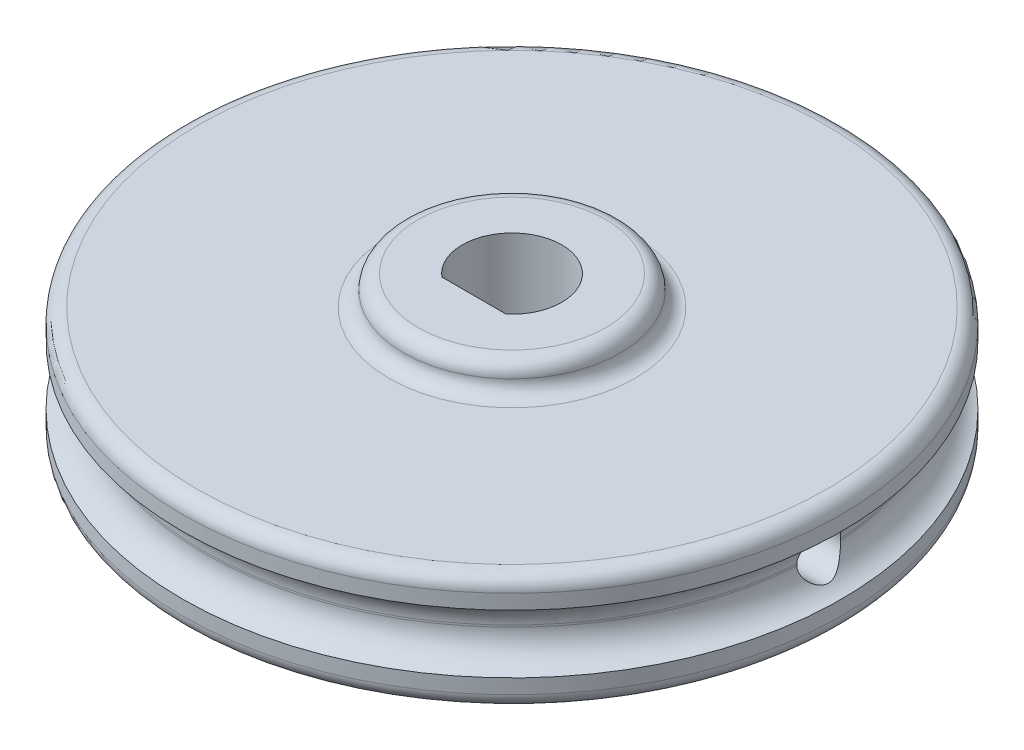
ISO-10303-21;
HEADER;
FILE_DESCRIPTION(('STEP AP214'),'2;1');
FILE_NAME('part.step','',(''),(''),'','','');
FILE_SCHEMA(('AUTOMOTIVE_DESIGN { 1 0 10303 214 1 1 1 1 }'));
ENDSEC;
DATA;
#1=APPLICATION_CONTEXT('core data for automotive mechanical design processes');
#2=APPLICATION_PROTOCOL_DEFINITION('international standard','automotive_design',2000,#1);
#3=PRODUCT_CONTEXT('',#1,'mechanical');
#4=PRODUCT('Part','Part','',(#3));
#5=PRODUCT_RELATED_PRODUCT_CATEGORY('part','',(#4));
#6=PRODUCT_DEFINITION_FORMATION('','',#4);
#7=PRODUCT_DEFINITION_CONTEXT('part definition',#1,'design');
#8=PRODUCT_DEFINITION('design','',#6,#7);
#9=PRODUCT_DEFINITION_SHAPE('','',#8);
#10=(LENGTH_UNIT() NAMED_UNIT(*) SI_UNIT(.MILLI.,.METRE.));
#11=(NAMED_UNIT(*) PLANE_ANGLE_UNIT() SI_UNIT($,.RADIAN.));
#12=(NAMED_UNIT(*) SI_UNIT($,.STERADIAN.) SOLID_ANGLE_UNIT());
#13=UNCERTAINTY_MEASURE_WITH_UNIT(LENGTH_MEASURE(1.E-05),#10,'distance_accuracy_value','');
#14=(GEOMETRIC_REPRESENTATION_CONTEXT(3) GLOBAL_UNCERTAINTY_ASSIGNED_CONTEXT((#13)) GLOBAL_UNIT_ASSIGNED_CONTEXT((#10,
#11,#12)) REPRESENTATION_CONTEXT('',''));
#15=CARTESIAN_POINT('',(0.,0.,0.));
#16=DIRECTION('',(0.,0.,1.));
#17=DIRECTION('',(1.,0.,0.));
#18=AXIS2_PLACEMENT_3D('',#15,#16,#17);
#19=CARTESIAN_POINT('',(0.,1.,0.));
#20=DIRECTION('',(0.,1.,0.));
#21=DIRECTION('',(0.,0.,1.));
#22=AXIS2_PLACEMENT_3D('',#19,#20,#21);
#23=CYLINDRICAL_SURFACE('',#22,10.5);
#24=CARTESIAN_POINT('',(10.5,1.25,0.));
#25=CARTESIAN_POINT('',(10.4999996459103,1.25000184599413,-0.0420702896906977));
#26=CARTESIAN_POINT('',(10.4997444551651,1.25355171822834,-0.0841697151823444));
#27=CARTESIAN_POINT('',(10.4987509831414,1.26766139121766,-0.167205182120869));
#28=CARTESIAN_POINT('',(10.498012145491,1.27822926546172,-0.208139826981758));
#29=CARTESIAN_POINT('',(10.4961349265712,1.30606904120026,-0.287631003955275));
#30=CARTESIAN_POINT('',(10.4949967621383,1.32333730488777,-0.326188813369015));
#31=CARTESIAN_POINT('',(10.4924487544025,1.36408153169771,-0.399848850525432));
#32=CARTESIAN_POINT('',(10.4910389717174,1.38755611017494,-0.434951846651903));
#33=CARTESIAN_POINT('',(10.4881030726537,1.44009542926148,-0.500782673246313));
#34=CARTESIAN_POINT('',(10.4865767636156,1.46916955424612,-0.531503006126405));
#35=CARTESIAN_POINT('',(10.4835814686867,1.53206306264146,-0.587632246842263));
#36=CARTESIAN_POINT('',(10.4821124852406,1.56588264814997,-0.613040928352703));
#37=CARTESIAN_POINT('',(10.4793959681773,1.63735098714617,-0.657849846643447));
#38=CARTESIAN_POINT('',(10.4781486713077,1.67500376758182,-0.67724367619479));
#39=CARTESIAN_POINT('',(10.4760187472181,1.7530415126039,-0.7094314113739));
#40=CARTESIAN_POINT('',(10.4751361150887,1.79342644040015,-0.722225405852854));
#41=CARTESIAN_POINT('',(10.4738369325609,1.87570839162719,-0.740829017574956));
#42=CARTESIAN_POINT('',(10.4734195824702,1.91760269248613,-0.746650619734161));
#43=CARTESIAN_POINT('',(10.4730956369413,2.00177576001648,-0.751181201960244));
#44=CARTESIAN_POINT('',(10.4731890342245,2.04405452120034,-0.749890283388113));
#45=CARTESIAN_POINT('',(10.4738753090453,2.12771452376762,-0.740242395612946));
#46=CARTESIAN_POINT('',(10.474467268304,2.16909727184382,-0.73189841702248));
#47=CARTESIAN_POINT('',(10.4760825183323,2.24987332351781,-0.708401426837434));
#48=CARTESIAN_POINT('',(10.47710581233,2.28926661222396,-0.693248364283407));
#49=CARTESIAN_POINT('',(10.4794694790249,2.36498712035384,-0.656548677846591));
#50=CARTESIAN_POINT('',(10.4808101424809,2.40131148652241,-0.634996186479635));
#51=CARTESIAN_POINT('',(10.4836571938165,2.46983183870472,-0.586113680368512));
#52=CARTESIAN_POINT('',(10.4851635841476,2.50202776363298,-0.558783580153214));
#53=CARTESIAN_POINT('',(10.4881764228053,2.56145287140962,-0.499048612415012));
#54=CARTESIAN_POINT('',(10.4896828636933,2.58867075958108,-0.466632507153405));
#55=CARTESIAN_POINT('',(10.4925228165297,2.63727997610893,-0.39768502342269));
#56=CARTESIAN_POINT('',(10.4938563283987,2.65867130178951,-0.361153643063687));
#57=CARTESIAN_POINT('',(10.4962003244408,2.69501931635249,-0.285005555863405));
#58=CARTESIAN_POINT('',(10.4972107857048,2.7099755489187,-0.245388630459512));
#59=CARTESIAN_POINT('',(10.4987945352409,2.73302113747236,-0.164197212882698));
#60=CARTESIAN_POINT('',(10.4993678301788,2.74111059816333,-0.122622750568214));
#61=CARTESIAN_POINT('',(10.5000117922214,2.75017895251046,-0.0387943631342636));
#62=CARTESIAN_POINT('',(10.500083562751,2.75117345617865,0.00345786522529639));
#63=CARTESIAN_POINT('',(10.4997193287321,2.74606449456017,0.0875285011581588));
#64=CARTESIAN_POINT('',(10.4992833276481,2.7399610777016,0.129346911689374));
#65=CARTESIAN_POINT('',(10.4979533231659,2.72084245885006,0.211318656604785));
#66=CARTESIAN_POINT('',(10.4970597962996,2.70783444775911,0.251473676535794));
#67=CARTESIAN_POINT('',(10.4949152049575,2.6752832091945,0.329030885913476));
#68=CARTESIAN_POINT('',(10.4936641362964,2.65573990521888,0.366433043128962));
#69=CARTESIAN_POINT('',(10.4909421529722,2.61063330617983,0.437494126946804));
#70=CARTESIAN_POINT('',(10.4894708604022,2.58505961862585,0.471146442137264));
#71=CARTESIAN_POINT('',(10.4864751699143,2.52863327692314,0.533685949062769));
#72=CARTESIAN_POINT('',(10.4849507713176,2.49778055525561,0.562573079841865));
#73=CARTESIAN_POINT('',(10.4820174518027,2.43160443775544,0.614815360932158));
#74=CARTESIAN_POINT('',(10.4806087458173,2.39627301779258,0.638160360675093));
#75=CARTESIAN_POINT('',(10.4780691343544,2.32218260558675,0.678586204627138));
#76=CARTESIAN_POINT('',(10.4769382267417,2.28342363969174,0.695667096984014));
#77=CARTESIAN_POINT('',(10.4750833134738,2.20361498876529,0.723062396609295));
#78=CARTESIAN_POINT('',(10.4743589278796,2.1625674822104,0.733383123502618));
#79=CARTESIAN_POINT('',(10.4733977069656,2.07931684901751,0.74698573941904));
#80=CARTESIAN_POINT('',(10.4731608650347,2.03711373805777,0.750267723889857));
#81=CARTESIAN_POINT('',(10.4732016044349,1.95285078494325,0.749698708386966));
#82=CARTESIAN_POINT('',(10.4734780352141,1.91079083357409,0.745863661958517));
#83=CARTESIAN_POINT('',(10.4745117313722,1.82791381916018,0.731202599756694));
#84=CARTESIAN_POINT('',(10.4752689975745,1.78709675824405,0.720376572011129));
#85=CARTESIAN_POINT('',(10.4771787426215,1.70786234680122,0.692044645056291));
#86=CARTESIAN_POINT('',(10.478331211915,1.66944493830711,0.674538907278669));
#87=CARTESIAN_POINT('',(10.4809014997491,1.5960920886772,0.633346462801262));
#88=CARTESIAN_POINT('',(10.4823193124875,1.56115657142927,0.609659891251878));
#89=CARTESIAN_POINT('',(10.4852642693368,1.49567786820655,0.556718578197045));
#90=CARTESIAN_POINT('',(10.4867916386566,1.46514414213574,0.527452149288891));
#91=CARTESIAN_POINT('',(10.4897816015316,1.40941154473007,0.464200561093081));
#92=CARTESIAN_POINT('',(10.4912441792185,1.38421397462793,0.430214254191139));
#93=CARTESIAN_POINT('',(10.4939417089127,1.33984450426722,0.358438546976615));
#94=CARTESIAN_POINT('',(10.4951763209639,1.32068157368202,0.320643594660229));
#95=CARTESIAN_POINT('',(10.4972745233087,1.28899744145457,0.242390654676055));
#96=CARTESIAN_POINT('',(10.4981385447485,1.27646851778678,0.201935825086028));
#97=CARTESIAN_POINT('',(10.4991736015175,1.26163871820478,0.134364084627482));
#98=CARTESIAN_POINT('',(10.4994821105472,1.25727990411502,0.107683123255775));
#99=CARTESIAN_POINT('',(10.4998954232599,1.25145995515487,0.0540054436549144));
#100=CARTESIAN_POINT('',(10.5000002273222,1.24999881488932,0.0270087260137571));
#101=CARTESIAN_POINT('',(10.5,1.25,0.));
#102=B_SPLINE_CURVE_WITH_KNOTS('',3,(#24,#25,#26,#27,#28,#29,#30,#31,#32,#33,#34,#35,#36,#37,
#38,#39,#40,#41,#42,#43,#44,#45,#46,#47,#48,#49,#50,#51,#52,#53,#54,#55,#56,#57,#58,#59,#60,#61,
#62,#63,#64,#65,#66,#67,#68,#69,#70,#71,#72,#73,#74,#75,#76,#77,#78,#79,#80,#81,#82,#83,#84,#85,
#86,#87,#88,#89,#90,#91,#92,#93,#94,#95,#96,#97,#98,#99,#100,#101),.UNSPECIFIED.,.T.,.F.,(4,2,2,
2,2,2,2,2,2,2,2,2,2,2,2,2,2,2,2,2,2,2,2,2,2,2,2,2,2,2,2,2,2,2,2,2,2,2,4),(0.,0.126112265961033,
0.252369863006392,0.378559007381876,0.504720022348824,0.631094342082059,0.757474045429571,
0.883987914066162,1.01050007944795,1.13679446823782,1.26308705720284,1.38914754092121,
1.51520896809682,1.64138633679889,1.76756557223815,1.89402763749129,2.02048976082097,
2.14696085017569,2.27343001108324,2.39962083405724,2.52581079605448,2.65186959258432,
2.77792986480653,2.90420899213916,3.03048973470147,3.15700000977925,3.28350931244157,
3.40990018061744,3.53628933487972,3.66239551721201,3.78850191550416,3.91460526631748,
4.04070585998008,4.1670735410398,4.29347200172802,4.42005745939435,4.54649524506669,
4.6274582715924,4.7084211473738),.UNSPECIFIED.);
#103=CARTESIAN_POINT('',(10.473228171242,1.96824583655185,-0.74932748054753));
#104=VERTEX_POINT('',#103);
#105=CARTESIAN_POINT('',(10.473228171242,2.03175416344815,-0.749327480547627));
#106=VERTEX_POINT('',#105);
#107=EDGE_CURVE('E170',#104,#106,#102,.T.);
#108=ORIENTED_EDGE('',*,*,#107,.F.);
#109=CARTESIAN_POINT('',(0.,1.96824583655185,0.));
#110=DIRECTION('',(0.,-1.,0.));
#111=DIRECTION('',(0.,0.,-1.));
#112=AXIS2_PLACEMENT_3D('',#109,#110,#111);
#113=CIRCLE('',#112,10.5);
#114=CARTESIAN_POINT('',(-10.473228171242,1.96824583655185,-0.749327480547627));
#115=VERTEX_POINT('',#114);
#116=EDGE_CURVE('E270',#104,#115,#113,.F.);
#117=ORIENTED_EDGE('',*,*,#116,.T.);
#118=CARTESIAN_POINT('',(-10.5,2.75,0.));
#119=CARTESIAN_POINT('',(-10.4999996459103,2.74999815400587,-0.0420702896906977));
#120=CARTESIAN_POINT('',(-10.4997444551651,2.74644828177166,-0.0841697151823444));
#121=CARTESIAN_POINT('',(-10.4987509831414,2.73233860878234,-0.167205182120869));
#122=CARTESIAN_POINT('',(-10.498012145491,2.72177073453828,-0.208139826981758));
#123=CARTESIAN_POINT('',(-10.4961349265712,2.69393095879974,-0.287631003955275));
#124=CARTESIAN_POINT('',(-10.4949967621383,2.67666269511223,-0.326188813369015));
#125=CARTESIAN_POINT('',(-10.4924487544025,2.63591846830229,-0.399848850525433));
#126=CARTESIAN_POINT('',(-10.4910389717174,2.61244388982507,-0.434951846651904));
#127=CARTESIAN_POINT('',(-10.4881030726537,2.55990457073852,-0.500782673246313));
#128=CARTESIAN_POINT('',(-10.4865767636156,2.53083044575388,-0.531503006126405));
#129=CARTESIAN_POINT('',(-10.4835814686867,2.46793693735854,-0.587632246842264));
#130=CARTESIAN_POINT('',(-10.4821124852406,2.43411735185003,-0.613040928352703));
#131=CARTESIAN_POINT('',(-10.4793959681773,2.36264901285383,-0.657849846643447));
#132=CARTESIAN_POINT('',(-10.4781486713077,2.32499623241818,-0.677243676194791));
#133=CARTESIAN_POINT('',(-10.4760187472181,2.2469584873961,-0.7094314113739));
#134=CARTESIAN_POINT('',(-10.4751361150887,2.20657355959985,-0.722225405852854));
#135=CARTESIAN_POINT('',(-10.4738369325609,2.12429160837281,-0.740829017574956));
#136=CARTESIAN_POINT('',(-10.4734195824702,2.08239730751387,-0.746650619734162));
#137=CARTESIAN_POINT('',(-10.4730956369413,1.99822423998352,-0.751181201960243));
#138=CARTESIAN_POINT('',(-10.4731890342245,1.95594547879966,-0.749890283388113));
#139=CARTESIAN_POINT('',(-10.4738753090453,1.87228547623238,-0.740242395612946));
#140=CARTESIAN_POINT('',(-10.474467268304,1.83090272815618,-0.73189841702248));
#141=CARTESIAN_POINT('',(-10.4760825183323,1.75012667648219,-0.708401426837434));
#142=CARTESIAN_POINT('',(-10.47710581233,1.71073338777604,-0.693248364283407));
#143=CARTESIAN_POINT('',(-10.4794694790249,1.63501287964616,-0.656548677846591));
#144=CARTESIAN_POINT('',(-10.4808101424809,1.59868851347759,-0.634996186479635));
#145=CARTESIAN_POINT('',(-10.4836571938165,1.53016816129528,-0.586113680368512));
#146=CARTESIAN_POINT('',(-10.4851635841476,1.49797223636702,-0.558783580153214));
#147=CARTESIAN_POINT('',(-10.4881764228053,1.43854712859038,-0.499048612415011));
#148=CARTESIAN_POINT('',(-10.4896828636933,1.41132924041892,-0.466632507153404));
#149=CARTESIAN_POINT('',(-10.4925228165297,1.36272002389107,-0.397685023422689));
#150=CARTESIAN_POINT('',(-10.4938563283987,1.34132869821049,-0.361153643063687));
#151=CARTESIAN_POINT('',(-10.4962003244408,1.30498068364751,-0.285005555863404));
#152=CARTESIAN_POINT('',(-10.4972107857048,1.2900244510813,-0.245388630459511));
#153=CARTESIAN_POINT('',(-10.4987945352409,1.26697886252765,-0.164197212882697));
#154=CARTESIAN_POINT('',(-10.4993678301788,1.25888940183667,-0.122622750568213));
#155=CARTESIAN_POINT('',(-10.5000117922214,1.24982104748954,-0.0387943631342629));
#156=CARTESIAN_POINT('',(-10.500083562751,1.24882654382135,0.00345786522529706));
#157=CARTESIAN_POINT('',(-10.4997193287321,1.25393550543983,0.0875285011581595));
#158=CARTESIAN_POINT('',(-10.4992833276481,1.2600389222984,0.129346911689374));
#159=CARTESIAN_POINT('',(-10.4979533231659,1.27915754114994,0.211318656604786));
#160=CARTESIAN_POINT('',(-10.4970597962996,1.29216555224089,0.251473676535795));
#161=CARTESIAN_POINT('',(-10.4949152049575,1.3247167908055,0.329030885913477));
#162=CARTESIAN_POINT('',(-10.4936641362964,1.34426009478112,0.366433043128963));
#163=CARTESIAN_POINT('',(-10.4909421529722,1.38936669382017,0.437494126946805));
#164=CARTESIAN_POINT('',(-10.4894708604022,1.41494038137415,0.471146442137264));
#165=CARTESIAN_POINT('',(-10.4864751699143,1.47136672307686,0.533685949062769));
#166=CARTESIAN_POINT('',(-10.4849507713176,1.50221944474439,0.562573079841865));
#167=CARTESIAN_POINT('',(-10.4820174518027,1.56839556224456,0.614815360932158));
#168=CARTESIAN_POINT('',(-10.4806087458173,1.60372698220742,0.638160360675093));
#169=CARTESIAN_POINT('',(-10.4780691343544,1.67781739441326,0.678586204627138));
#170=CARTESIAN_POINT('',(-10.4769382267417,1.71657636030826,0.695667096984014));
#171=CARTESIAN_POINT('',(-10.4750833134738,1.79638501123471,0.723062396609295));
#172=CARTESIAN_POINT('',(-10.4743589278796,1.8374325177896,0.733383123502618));
#173=CARTESIAN_POINT('',(-10.4733977069656,1.92068315098249,0.74698573941904));
#174=CARTESIAN_POINT('',(-10.4731608650347,1.96288626194223,0.750267723889857));
#175=CARTESIAN_POINT('',(-10.4732016044349,2.04714921505675,0.749698708386966));
#176=CARTESIAN_POINT('',(-10.4734780352141,2.08920916642592,0.745863661958517));
#177=CARTESIAN_POINT('',(-10.4745117313722,2.17208618083982,0.731202599756693));
#178=CARTESIAN_POINT('',(-10.4752689975745,2.21290324175595,0.720376572011129));
#179=CARTESIAN_POINT('',(-10.4771787426215,2.29213765319878,0.692044645056291));
#180=CARTESIAN_POINT('',(-10.478331211915,2.33055506169289,0.674538907278668));
#181=CARTESIAN_POINT('',(-10.4809014997491,2.4039079113228,0.633346462801262));
#182=CARTESIAN_POINT('',(-10.4823193124875,2.43884342857073,0.609659891251878));
#183=CARTESIAN_POINT('',(-10.4852642693368,2.50432213179345,0.556718578197044));
#184=CARTESIAN_POINT('',(-10.4867916386566,2.53485585786426,0.527452149288891));
#185=CARTESIAN_POINT('',(-10.4897816015316,2.59058845526993,0.464200561093081));
#186=CARTESIAN_POINT('',(-10.4912441792185,2.61578602537207,0.430214254191138));
#187=CARTESIAN_POINT('',(-10.4939417089127,2.66015549573278,0.358438546976614));
#188=CARTESIAN_POINT('',(-10.4951763209639,2.67931842631798,0.320643594660229));
#189=CARTESIAN_POINT('',(-10.4972745233087,2.71100255854543,0.242390654676054));
#190=CARTESIAN_POINT('',(-10.4981385447485,2.72353148221322,0.201935825086028));
#191=CARTESIAN_POINT('',(-10.4991736015175,2.73836128179522,0.134364084627481));
#192=CARTESIAN_POINT('',(-10.4994821105472,2.74272009588498,0.107683123255775));
#193=CARTESIAN_POINT('',(-10.4998954232599,2.74854004484513,0.0540054436549143));
#194=CARTESIAN_POINT('',(-10.5000002273222,2.75000118511068,0.027008726013757));
#195=CARTESIAN_POINT('',(-10.5,2.75,0.));
#196=B_SPLINE_CURVE_WITH_KNOTS('',3,(#118,#119,#120,#121,#122,#123,#124,#125,#126,#127,#128,
#129,#130,#131,#132,#133,#134,#135,#136,#137,#138,#139,#140,#141,#142,#143,#144,#145,#146,#147,
#148,#149,#150,#151,#152,#153,#154,#155,#156,#157,#158,#159,#160,#161,#162,#163,#164,#165,#166,
#167,#168,#169,#170,#171,#172,#173,#174,#175,#176,#177,#178,#179,#180,#181,#182,#183,#184,#185,
#186,#187,#188,#189,#190,#191,#192,#193,#194,#195),.UNSPECIFIED.,.T.,.F.,(4,2,2,2,2,2,2,2,2,2,2,
2,2,2,2,2,2,2,2,2,2,2,2,2,2,2,2,2,2,2,2,2,2,2,2,2,2,2,4),(0.,0.126112265961033,
0.252369863006392,0.378559007381876,0.504720022348824,0.631094342082059,0.757474045429571,
0.883987914066162,1.01050007944795,1.13679446823782,1.26308705720284,1.38914754092121,
1.51520896809682,1.64138633679889,1.76756557223815,1.89402763749129,2.02048976082097,
2.14696085017569,2.27343001108324,2.39962083405724,2.52581079605448,2.65186959258432,
2.77792986480653,2.90420899213916,3.03048973470147,3.15700000977925,3.28350931244157,
3.40990018061744,3.53628933487972,3.66239551721201,3.78850191550416,3.91460526631748,
4.04070585998008,4.1670735410398,4.29347200172802,4.42005745939435,4.54649524506669,
4.6274582715924,4.7084211473738),.UNSPECIFIED.);
#197=CARTESIAN_POINT('',(-10.473228171242,2.03175416344814,-0.74932748054753));
#198=VERTEX_POINT('',#197);
#199=EDGE_CURVE('E149',#198,#115,#196,.T.);
#200=ORIENTED_EDGE('',*,*,#199,.F.);
#201=CARTESIAN_POINT('',(0.,2.03175416344815,0.));
#202=DIRECTION('',(0.,1.,0.));
#203=DIRECTION('',(0.,0.,1.));
#204=AXIS2_PLACEMENT_3D('',#201,#202,#203);
#205=CIRCLE('',#204,10.5);
#206=EDGE_CURVE('E266',#198,#106,#205,.F.);
#207=ORIENTED_EDGE('',*,*,#206,.T.);
#208=EDGE_LOOP('',(#108,#117,#200,#207));
#209=FACE_BOUND('',#208,.T.);
#210=ADVANCED_FACE('F65',(#209),#23,.T.);
#211=CARTESIAN_POINT('',(0.,4.,0.));
#212=DIRECTION('',(0.,-1.,0.));
#213=DIRECTION('',(0.,0.,-1.));
#214=AXIS2_PLACEMENT_3D('',#211,#212,#213);
#215=CYLINDRICAL_SURFACE('',#214,11.25);
#216=CARTESIAN_POINT('',(0.,0.5,0.));
#217=DIRECTION('',(0.,1.,0.));
#218=DIRECTION('',(0.,0.,1.));
#219=AXIS2_PLACEMENT_3D('',#216,#217,#218);
#220=CIRCLE('',#219,11.25);
#221=CARTESIAN_POINT('',(0.,0.5,11.25));
#222=VERTEX_POINT('',#221);
#223=EDGE_CURVE('E240',#222,#222,#220,.T.);
#224=ORIENTED_EDGE('',*,*,#223,.T.);
#225=EDGE_LOOP('',(#224));
#226=FACE_BOUND('',#225,.T.);
#227=CARTESIAN_POINT('',(0.,1.,0.));
#228=DIRECTION('',(0.,1.,0.));
#229=DIRECTION('',(0.,0.,1.));
#230=AXIS2_PLACEMENT_3D('',#227,#228,#229);
#231=CIRCLE('',#230,11.25);
#232=CARTESIAN_POINT('',(0.,1.,11.25));
#233=VERTEX_POINT('',#232);
#234=EDGE_CURVE('E260',#233,#233,#231,.T.);
#235=ORIENTED_EDGE('',*,*,#234,.F.);
#236=EDGE_LOOP('',(#235));
#237=FACE_BOUND('',#236,.T.);
#238=ADVANCED_FACE('F183',(#226,#237),#215,.T.);
#239=CARTESIAN_POINT('',(12.5,2.,0.));
#240=DIRECTION('',(-1.,0.,0.));
#241=DIRECTION('',(0.,-1.,0.));
#242=AXIS2_PLACEMENT_3D('',#239,#240,#241);
#243=CYLINDRICAL_SURFACE('',#242,0.750000000000001);
#244=CARTESIAN_POINT('',(9.13677438108973,2.,0.));
#245=DIRECTION('',(1.,0.,0.));
#246=DIRECTION('',(0.,0.,1.));
#247=AXIS2_PLACEMENT_3D('',#244,#245,#246);
#248=CIRCLE('',#247,0.750000000000001);
#249=CARTESIAN_POINT('',(9.13677438108973,2.75,0.));
#250=VERTEX_POINT('',#249);
#251=EDGE_CURVE('E141',#250,#250,#248,.T.);
#252=ORIENTED_EDGE('',*,*,#251,.F.);
#253=EDGE_LOOP('',(#252));
#254=FACE_BOUND('',#253,.T.);
#255=ORIENTED_EDGE('',*,*,#107,.T.);
#256=CARTESIAN_POINT('',(10.473228171242,2.03175416344814,-0.74932748054753));
#257=CARTESIAN_POINT('',(10.4732806037205,2.05001902725032,-0.74855561269119));
#258=CARTESIAN_POINT('',(10.4738887687864,2.06824200255767,-0.747111744595877));
#259=CARTESIAN_POINT('',(10.4761734237488,2.10445370077412,-0.742913823979604));
#260=CARTESIAN_POINT('',(10.4778490154327,2.12244260767149,-0.740160873511891));
#261=CARTESIAN_POINT('',(10.4843763784667,2.17557344460293,-0.730043538900081));
#262=CARTESIAN_POINT('',(10.490731246567,2.21019708904105,-0.720806139207487));
#263=CARTESIAN_POINT('',(10.5067765620968,2.2769404781224,-0.697889379802058));
#264=CARTESIAN_POINT('',(10.5164570103892,2.30906737873837,-0.684223342730422));
#265=CARTESIAN_POINT('',(10.538361973745,2.37048567725323,-0.65301547359613));
#266=CARTESIAN_POINT('',(10.5505908112121,2.39977213208269,-0.635467053342104));
#267=CARTESIAN_POINT('',(10.5782059383724,2.45826625765154,-0.594892396799979));
#268=CARTESIAN_POINT('',(10.5937919225371,2.48710598517338,-0.571474732895549));
#269=CARTESIAN_POINT('',(10.625975449341,2.54078765138728,-0.520969626270178));
#270=CARTESIAN_POINT('',(10.6425746130133,2.56562293910419,-0.49387621314159));
#271=CARTESIAN_POINT('',(10.6791803168864,2.6160483256704,-0.430091989709004));
#272=CARTESIAN_POINT('',(10.6991504544089,2.6406481993613,-0.392591066986179));
#273=CARTESIAN_POINT('',(10.7363154000212,2.68317718981096,-0.312736079103994));
#274=CARTESIAN_POINT('',(10.7535169057677,2.70112254622764,-0.270394163052405));
#275=CARTESIAN_POINT('',(10.7765044162783,2.72404983306205,-0.197777717832519));
#276=CARTESIAN_POINT('',(10.7841588500075,2.7313714092633,-0.168841006129399));
#277=CARTESIAN_POINT('',(10.7960403660927,2.74254991872326,-0.109647652311246));
#278=CARTESIAN_POINT('',(10.8002747993197,2.7464142847676,-0.0793939892317464));
#279=CARTESIAN_POINT('',(10.8046560344002,2.75041061633329,-0.0181520491874947));
#280=CARTESIAN_POINT('',(10.8047789486244,2.75052077022226,0.0128394742264242));
#281=CARTESIAN_POINT('',(10.8008533228309,2.74694333229991,0.0743457660983718));
#282=CARTESIAN_POINT('',(10.7968005290056,2.74325186776919,0.104860016178562));
#283=CARTESIAN_POINT('',(10.7841993292165,2.73142265922481,0.169662372141584));
#284=CARTESIAN_POINT('',(10.7749986794703,2.72263049369777,0.203699235075611));
#285=CARTESIAN_POINT('',(10.7533440670678,2.70083762631143,0.269310846406631));
#286=CARTESIAN_POINT('',(10.7408824291916,2.68782697812368,0.300879554884404));
#287=CARTESIAN_POINT('',(10.7094232641402,2.65281839242606,0.372033869214088));
#288=CARTESIAN_POINT('',(10.6896708400859,2.62926913728728,0.410519231652818));
#289=CARTESIAN_POINT('',(10.6495246067262,2.5759147796019,0.482527087968066));
#290=CARTESIAN_POINT('',(10.62913000721,2.54610169137252,0.51604315260878));
#291=CARTESIAN_POINT('',(10.5895930252779,2.48004828044414,0.578039348308694));
#292=CARTESIAN_POINT('',(10.5704688209865,2.44373442140037,0.60645350244673));
#293=CARTESIAN_POINT('',(10.5359048820793,2.36527464127877,0.656679273565678));
#294=CARTESIAN_POINT('',(10.520455288977,2.3231448153939,0.678508600000654));
#295=CARTESIAN_POINT('',(10.4991717647801,2.24764371033194,0.708722928399011));
#296=CARTESIAN_POINT('',(10.4918422985029,2.21551643615107,0.719177746592552));
#297=CARTESIAN_POINT('',(10.4806309131238,2.14962080893195,0.735701918150447));
#298=CARTESIAN_POINT('',(10.4767398606866,2.11585705630917,0.741782881575987));
#299=CARTESIAN_POINT('',(10.4737856173396,2.06514819811267,0.74735588378033));
#300=CARTESIAN_POINT('',(10.4732697153668,2.04846117912715,0.74862772924685));
#301=CARTESIAN_POINT('',(10.473228171242,2.03175416344814,0.74932748054753));
#302=B_SPLINE_CURVE_WITH_KNOTS('',3,(#256,#257,#258,#259,#260,#261,#262,#263,#264,#265,#266,
#267,#268,#269,#270,#271,#272,#273,#274,#275,#276,#277,#278,#279,#280,#281,#282,#283,#284,#285,
#286,#287,#288,#289,#290,#291,#292,#293,#294,#295,#296,#297,#298,#299,#300,#301),.UNSPECIFIED.,
.F.,.F.,(4,2,2,2,2,2,2,2,2,2,2,2,2,2,2,2,2,2,2,2,2,2,4),(0.,0.0548012624026914,
0.109556471724453,0.218127706367813,0.326375312577097,0.434808037537853,0.555249736951669,
0.675889462064557,0.822521348090419,0.96879300179728,1.0608975416616,1.15280358332027,
1.24524350028215,1.33777767928758,1.4461948240455,1.55486947638167,1.70187933090936,
1.84907775624351,1.99806068164263,2.14663927983346,2.24993444765413,2.35295440423366,
2.40312235157218),.UNSPECIFIED.);
#303=CARTESIAN_POINT('',(10.473228171242,2.03175416344814,0.749327480547532));
#304=VERTEX_POINT('',#303);
#305=EDGE_CURVE('E198',#106,#304,#302,.T.);
#306=ORIENTED_EDGE('',*,*,#305,.T.);
#307=CARTESIAN_POINT('',(10.473228171242,1.96824583655185,0.74932748054753));
#308=VERTEX_POINT('',#307);
#309=EDGE_CURVE('E156',#304,#308,#102,.T.);
#310=ORIENTED_EDGE('',*,*,#309,.T.);
#311=CARTESIAN_POINT('',(10.473228171242,1.96824583655185,0.74932748054753));
#312=CARTESIAN_POINT('',(10.4732806037205,1.94998097274967,0.74855561269119));
#313=CARTESIAN_POINT('',(10.4738887687864,1.93175799744233,0.747111744595877));
#314=CARTESIAN_POINT('',(10.4761734237488,1.89554629922588,0.742913823979604));
#315=CARTESIAN_POINT('',(10.4778490154327,1.87755739232851,0.740160873511891));
#316=CARTESIAN_POINT('',(10.4843763784667,1.82442655539706,0.73004353890008));
#317=CARTESIAN_POINT('',(10.490731246567,1.78980291095895,0.720806139207486));
#318=CARTESIAN_POINT('',(10.5067765620968,1.7230595218776,0.697889379802057));
#319=CARTESIAN_POINT('',(10.5164570103892,1.69093262126163,0.68422334273042));
#320=CARTESIAN_POINT('',(10.538361973745,1.62951432274677,0.653015473596129));
#321=CARTESIAN_POINT('',(10.5505908112121,1.60022786791731,0.635467053342102));
#322=CARTESIAN_POINT('',(10.5782059383724,1.54173374234846,0.594892396799976));
#323=CARTESIAN_POINT('',(10.5937919225371,1.51289401482662,0.571474732895546));
#324=CARTESIAN_POINT('',(10.625975449341,1.45921234861272,0.520969626270175));
#325=CARTESIAN_POINT('',(10.6425746130133,1.43437706089581,0.493876213141588));
#326=CARTESIAN_POINT('',(10.6791803168864,1.3839516743296,0.430091989709));
#327=CARTESIAN_POINT('',(10.6991504544089,1.3593518006387,0.392591066986174));
#328=CARTESIAN_POINT('',(10.7363154000212,1.31682281018904,0.312736079103988));
#329=CARTESIAN_POINT('',(10.7535169057677,1.29887745377236,0.2703941630524));
#330=CARTESIAN_POINT('',(10.7765044162783,1.27595016693795,0.197777717832515));
#331=CARTESIAN_POINT('',(10.7841588500075,1.2686285907367,0.168841006129395));
#332=CARTESIAN_POINT('',(10.7960403660927,1.25745008127674,0.109647652311241));
#333=CARTESIAN_POINT('',(10.8002747993197,1.2535857152324,0.0793939892317419));
#334=CARTESIAN_POINT('',(10.8046560344002,1.24958938366671,0.0181520491874901));
#335=CARTESIAN_POINT('',(10.8047789486244,1.24947922977774,-0.0128394742264287));
#336=CARTESIAN_POINT('',(10.8008533228309,1.25305666770009,-0.0743457660983763));
#337=CARTESIAN_POINT('',(10.7968005290056,1.25674813223081,-0.104860016178567));
#338=CARTESIAN_POINT('',(10.7841993292165,1.26857734077519,-0.169662372141589));
#339=CARTESIAN_POINT('',(10.7749986794703,1.27736950630223,-0.203699235075616));
#340=CARTESIAN_POINT('',(10.7533440670678,1.29916237368858,-0.269310846406636));
#341=CARTESIAN_POINT('',(10.7408824291916,1.31217302187633,-0.300879554884409));
#342=CARTESIAN_POINT('',(10.7094232641402,1.34718160757394,-0.372033869214093));
#343=CARTESIAN_POINT('',(10.6896708400859,1.37073086271272,-0.410519231652823));
#344=CARTESIAN_POINT('',(10.6495246067262,1.4240852203981,-0.482527087968071));
#345=CARTESIAN_POINT('',(10.62913000721,1.45389830862748,-0.516043152608784));
#346=CARTESIAN_POINT('',(10.5895930252779,1.51995171955586,-0.578039348308698));
#347=CARTESIAN_POINT('',(10.5704688209865,1.55626557859964,-0.606453502446734));
#348=CARTESIAN_POINT('',(10.5359048820793,1.63472535872124,-0.656679273565682));
#349=CARTESIAN_POINT('',(10.520455288977,1.6768551846061,-0.678508600000657));
#350=CARTESIAN_POINT('',(10.4991717647801,1.75235628966807,-0.708722928399014));
#351=CARTESIAN_POINT('',(10.4918422985029,1.78448356384894,-0.719177746592555));
#352=CARTESIAN_POINT('',(10.4806309131238,1.85037919106805,-0.735701918150449));
#353=CARTESIAN_POINT('',(10.4767398606866,1.88414294369084,-0.741782881575988));
#354=CARTESIAN_POINT('',(10.4737856173396,1.93485180188734,-0.74735588378033));
#355=CARTESIAN_POINT('',(10.4732697153668,1.95153882087285,-0.748627729246849));
#356=CARTESIAN_POINT('',(10.473228171242,1.96824583655185,-0.74932748054753));
#357=B_SPLINE_CURVE_WITH_KNOTS('',3,(#311,#312,#313,#314,#315,#316,#317,#318,#319,#320,#321,
#322,#323,#324,#325,#326,#327,#328,#329,#330,#331,#332,#333,#334,#335,#336,#337,#338,#339,#340,
#341,#342,#343,#344,#345,#346,#347,#348,#349,#350,#351,#352,#353,#354,#355,#356),.UNSPECIFIED.,
.F.,.F.,(4,2,2,2,2,2,2,2,2,2,2,2,2,2,2,2,2,2,2,2,2,2,4),(0.,0.0548012624026913,
0.109556471724453,0.218127706367814,0.326375312577098,0.434808037537854,0.55524973695167,
0.675889462064559,0.822521348090423,0.968793001797281,1.0608975416616,1.15280358332028,
1.24524350028215,1.33777767928758,1.4461948240455,1.55486947638167,1.70187933090937,
1.84907775624352,1.99806068164263,2.14663927983347,2.24993444765414,2.35295440423366,
2.40312235157217),.UNSPECIFIED.);
#358=EDGE_CURVE('E191',#308,#104,#357,.T.);
#359=ORIENTED_EDGE('',*,*,#358,.T.);
#360=EDGE_LOOP('',(#255,#306,#310,#359));
#361=FACE_BOUND('',#360,.T.);
#362=ADVANCED_FACE('F179',(#254,#361),#243,.F.);
#363=CARTESIAN_POINT('',(-12.5,2.,0.));
#364=DIRECTION('',(1.,0.,0.));
#365=DIRECTION('',(0.,1.,0.));
#366=AXIS2_PLACEMENT_3D('',#363,#364,#365);
#367=CYLINDRICAL_SURFACE('',#366,0.750000000000001);
#368=CARTESIAN_POINT('',(-9.13677438108973,2.,0.));
#369=DIRECTION('',(1.,0.,0.));
#370=DIRECTION('',(0.,0.,1.));
#371=AXIS2_PLACEMENT_3D('',#368,#369,#370);
#372=CIRCLE('',#371,0.750000000000001);
#373=CARTESIAN_POINT('',(-9.13677438108973,2.75,0.));
#374=VERTEX_POINT('',#373);
#375=EDGE_CURVE('E177',#374,#374,#372,.F.);
#376=ORIENTED_EDGE('',*,*,#375,.F.);
#377=EDGE_LOOP('',(#376));
#378=FACE_BOUND('',#377,.T.);
#379=ORIENTED_EDGE('',*,*,#199,.T.);
#380=CARTESIAN_POINT('',(-10.473228171242,1.96824583655185,-0.74932748054753));
#381=CARTESIAN_POINT('',(-10.4732806037205,1.94998097274967,-0.74855561269119));
#382=CARTESIAN_POINT('',(-10.4738887687864,1.93175799744233,-0.747111744595877));
#383=CARTESIAN_POINT('',(-10.4761734237488,1.89554629922588,-0.742913823979604));
#384=CARTESIAN_POINT('',(-10.4778490154327,1.87755739232851,-0.740160873511891));
#385=CARTESIAN_POINT('',(-10.4843763784667,1.82442655539706,-0.73004353890008));
#386=CARTESIAN_POINT('',(-10.490731246567,1.78980291095895,-0.720806139207486));
#387=CARTESIAN_POINT('',(-10.5067765620968,1.7230595218776,-0.697889379802057));
#388=CARTESIAN_POINT('',(-10.5164570103892,1.69093262126163,-0.68422334273042));
#389=CARTESIAN_POINT('',(-10.538361973745,1.62951432274677,-0.653015473596129));
#390=CARTESIAN_POINT('',(-10.5505908112121,1.60022786791731,-0.635467053342102));
#391=CARTESIAN_POINT('',(-10.5782059383724,1.54173374234846,-0.594892396799976));
#392=CARTESIAN_POINT('',(-10.5937919225371,1.51289401482662,-0.571474732895546));
#393=CARTESIAN_POINT('',(-10.625975449341,1.45921234861272,-0.520969626270175));
#394=CARTESIAN_POINT('',(-10.6425746130133,1.43437706089581,-0.493876213141588));
#395=CARTESIAN_POINT('',(-10.6791803168864,1.3839516743296,-0.430091989709));
#396=CARTESIAN_POINT('',(-10.6991504544089,1.3593518006387,-0.392591066986174));
#397=CARTESIAN_POINT('',(-10.7363154000212,1.31682281018904,-0.312736079103988));
#398=CARTESIAN_POINT('',(-10.7535169057677,1.29887745377236,-0.2703941630524));
#399=CARTESIAN_POINT('',(-10.7765044162783,1.27595016693795,-0.197777717832515));
#400=CARTESIAN_POINT('',(-10.7841588500075,1.2686285907367,-0.168841006129395));
#401=CARTESIAN_POINT('',(-10.7960403660927,1.25745008127674,-0.109647652311241));
#402=CARTESIAN_POINT('',(-10.8002747993197,1.2535857152324,-0.0793939892317419));
#403=CARTESIAN_POINT('',(-10.8046560344002,1.24958938366671,-0.0181520491874901));
#404=CARTESIAN_POINT('',(-10.8047789486244,1.24947922977774,0.0128394742264287));
#405=CARTESIAN_POINT('',(-10.8008533228309,1.25305666770009,0.0743457660983763));
#406=CARTESIAN_POINT('',(-10.7968005290056,1.25674813223081,0.104860016178567));
#407=CARTESIAN_POINT('',(-10.7841993292165,1.26857734077519,0.169662372141589));
#408=CARTESIAN_POINT('',(-10.7749986794703,1.27736950630223,0.203699235075616));
#409=CARTESIAN_POINT('',(-10.7533440670678,1.29916237368858,0.269310846406636));
#410=CARTESIAN_POINT('',(-10.7408824291916,1.31217302187633,0.300879554884409));
#411=CARTESIAN_POINT('',(-10.7094232641402,1.34718160757394,0.372033869214093));
#412=CARTESIAN_POINT('',(-10.6896708400859,1.37073086271272,0.410519231652823));
#413=CARTESIAN_POINT('',(-10.6495246067262,1.4240852203981,0.482527087968071));
#414=CARTESIAN_POINT('',(-10.62913000721,1.45389830862748,0.516043152608784));
#415=CARTESIAN_POINT('',(-10.5895930252779,1.51995171955586,0.578039348308698));
#416=CARTESIAN_POINT('',(-10.5704688209865,1.55626557859964,0.606453502446734));
#417=CARTESIAN_POINT('',(-10.5359048820793,1.63472535872124,0.656679273565682));
#418=CARTESIAN_POINT('',(-10.520455288977,1.6768551846061,0.678508600000657));
#419=CARTESIAN_POINT('',(-10.4991717647801,1.75235628966807,0.708722928399014));
#420=CARTESIAN_POINT('',(-10.4918422985029,1.78448356384894,0.719177746592555));
#421=CARTESIAN_POINT('',(-10.4806309131238,1.85037919106805,0.735701918150449));
#422=CARTESIAN_POINT('',(-10.4767398606866,1.88414294369084,0.741782881575988));
#423=CARTESIAN_POINT('',(-10.4737856173396,1.93485180188734,0.74735588378033));
#424=CARTESIAN_POINT('',(-10.4732697153668,1.95153882087285,0.748627729246849));
#425=CARTESIAN_POINT('',(-10.473228171242,1.96824583655185,0.74932748054753));
#426=B_SPLINE_CURVE_WITH_KNOTS('',3,(#380,#381,#382,#383,#384,#385,#386,#387,#388,#389,#390,
#391,#392,#393,#394,#395,#396,#397,#398,#399,#400,#401,#402,#403,#404,#405,#406,#407,#408,#409,
#410,#411,#412,#413,#414,#415,#416,#417,#418,#419,#420,#421,#422,#423,#424,#425),.UNSPECIFIED.,
.F.,.F.,(4,2,2,2,2,2,2,2,2,2,2,2,2,2,2,2,2,2,2,2,2,2,4),(0.,0.0548012624026913,
0.109556471724453,0.218127706367814,0.326375312577098,0.434808037537854,0.55524973695167,
0.675889462064559,0.822521348090423,0.968793001797281,1.0608975416616,1.15280358332028,
1.24524350028215,1.33777767928758,1.4461948240455,1.55486947638167,1.70187933090937,
1.84907775624352,1.99806068164263,2.14663927983347,2.24993444765414,2.35295440423366,
2.40312235157217),.UNSPECIFIED.);
#427=CARTESIAN_POINT('',(-10.473228171242,1.96824583655185,0.749327480547532));
#428=VERTEX_POINT('',#427);
#429=EDGE_CURVE('E88',#115,#428,#426,.T.);
#430=ORIENTED_EDGE('',*,*,#429,.T.);
#431=CARTESIAN_POINT('',(-10.473228171242,2.03175416344814,0.749327480547531));
#432=VERTEX_POINT('',#431);
#433=EDGE_CURVE('E157',#428,#432,#196,.T.);
#434=ORIENTED_EDGE('',*,*,#433,.T.);
#435=CARTESIAN_POINT('',(-10.473228171242,2.03175416344814,0.74932748054753));
#436=CARTESIAN_POINT('',(-10.4732806037205,2.05001902725032,0.74855561269119));
#437=CARTESIAN_POINT('',(-10.4738887687864,2.06824200255767,0.747111744595877));
#438=CARTESIAN_POINT('',(-10.4761734237488,2.10445370077412,0.742913823979604));
#439=CARTESIAN_POINT('',(-10.4778490154327,2.12244260767149,0.740160873511891));
#440=CARTESIAN_POINT('',(-10.4843763784667,2.17557344460293,0.730043538900081));
#441=CARTESIAN_POINT('',(-10.490731246567,2.21019708904105,0.720806139207487));
#442=CARTESIAN_POINT('',(-10.5067765620968,2.2769404781224,0.697889379802058));
#443=CARTESIAN_POINT('',(-10.5164570103892,2.30906737873837,0.684223342730422));
#444=CARTESIAN_POINT('',(-10.538361973745,2.37048567725323,0.65301547359613));
#445=CARTESIAN_POINT('',(-10.5505908112121,2.39977213208269,0.635467053342104));
#446=CARTESIAN_POINT('',(-10.5782059383724,2.45826625765154,0.594892396799979));
#447=CARTESIAN_POINT('',(-10.5937919225371,2.48710598517338,0.571474732895549));
#448=CARTESIAN_POINT('',(-10.625975449341,2.54078765138728,0.520969626270178));
#449=CARTESIAN_POINT('',(-10.6425746130133,2.56562293910419,0.49387621314159));
#450=CARTESIAN_POINT('',(-10.6791803168864,2.6160483256704,0.430091989709004));
#451=CARTESIAN_POINT('',(-10.6991504544089,2.6406481993613,0.392591066986179));
#452=CARTESIAN_POINT('',(-10.7363154000212,2.68317718981096,0.312736079103994));
#453=CARTESIAN_POINT('',(-10.7535169057677,2.70112254622764,0.270394163052405));
#454=CARTESIAN_POINT('',(-10.7765044162783,2.72404983306205,0.197777717832519));
#455=CARTESIAN_POINT('',(-10.7841588500075,2.7313714092633,0.168841006129399));
#456=CARTESIAN_POINT('',(-10.7960403660927,2.74254991872326,0.109647652311246));
#457=CARTESIAN_POINT('',(-10.8002747993197,2.7464142847676,0.0793939892317464));
#458=CARTESIAN_POINT('',(-10.8046560344002,2.75041061633329,0.0181520491874947));
#459=CARTESIAN_POINT('',(-10.8047789486244,2.75052077022226,-0.0128394742264242));
#460=CARTESIAN_POINT('',(-10.8008533228309,2.74694333229991,-0.0743457660983718));
#461=CARTESIAN_POINT('',(-10.7968005290056,2.74325186776919,-0.104860016178562));
#462=CARTESIAN_POINT('',(-10.7841993292165,2.73142265922481,-0.169662372141584));
#463=CARTESIAN_POINT('',(-10.7749986794703,2.72263049369777,-0.203699235075611));
#464=CARTESIAN_POINT('',(-10.7533440670678,2.70083762631143,-0.269310846406631));
#465=CARTESIAN_POINT('',(-10.7408824291916,2.68782697812368,-0.300879554884404));
#466=CARTESIAN_POINT('',(-10.7094232641402,2.65281839242606,-0.372033869214088));
#467=CARTESIAN_POINT('',(-10.6896708400859,2.62926913728728,-0.410519231652818));
#468=CARTESIAN_POINT('',(-10.6495246067262,2.5759147796019,-0.482527087968066));
#469=CARTESIAN_POINT('',(-10.62913000721,2.54610169137252,-0.51604315260878));
#470=CARTESIAN_POINT('',(-10.5895930252779,2.48004828044414,-0.578039348308694));
#471=CARTESIAN_POINT('',(-10.5704688209865,2.44373442140037,-0.60645350244673));
#472=CARTESIAN_POINT('',(-10.5359048820793,2.36527464127877,-0.656679273565678));
#473=CARTESIAN_POINT('',(-10.520455288977,2.3231448153939,-0.678508600000654));
#474=CARTESIAN_POINT('',(-10.4991717647801,2.24764371033194,-0.708722928399011));
#475=CARTESIAN_POINT('',(-10.4918422985029,2.21551643615107,-0.719177746592552));
#476=CARTESIAN_POINT('',(-10.4806309131238,2.14962080893195,-0.735701918150447));
#477=CARTESIAN_POINT('',(-10.4767398606866,2.11585705630917,-0.741782881575987));
#478=CARTESIAN_POINT('',(-10.4737856173396,2.06514819811267,-0.74735588378033));
#479=CARTESIAN_POINT('',(-10.4732697153668,2.04846117912715,-0.74862772924685));
#480=CARTESIAN_POINT('',(-10.473228171242,2.03175416344814,-0.74932748054753));
#481=B_SPLINE_CURVE_WITH_KNOTS('',3,(#435,#436,#437,#438,#439,#440,#441,#442,#443,#444,#445,
#446,#447,#448,#449,#450,#451,#452,#453,#454,#455,#456,#457,#458,#459,#460,#461,#462,#463,#464,
#465,#466,#467,#468,#469,#470,#471,#472,#473,#474,#475,#476,#477,#478,#479,#480),.UNSPECIFIED.,
.F.,.F.,(4,2,2,2,2,2,2,2,2,2,2,2,2,2,2,2,2,2,2,2,2,2,4),(0.,0.0548012624026914,
0.109556471724453,0.218127706367813,0.326375312577097,0.434808037537853,0.555249736951669,
0.675889462064557,0.822521348090419,0.96879300179728,1.0608975416616,1.15280358332027,
1.24524350028215,1.33777767928758,1.4461948240455,1.55486947638167,1.70187933090936,
1.84907775624351,1.99806068164263,2.14663927983346,2.24993444765413,2.35295440423366,
2.40312235157218),.UNSPECIFIED.);
#482=EDGE_CURVE('E225',#432,#198,#481,.T.);
#483=ORIENTED_EDGE('',*,*,#482,.T.);
#484=EDGE_LOOP('',(#379,#430,#434,#483));
#485=FACE_BOUND('',#484,.T.);
#486=ADVANCED_FACE('F160',(#378,#485),#367,.F.);
#487=CARTESIAN_POINT('',(0.,3.5,0.));
#488=DIRECTION('',(0.,1.,0.));
#489=DIRECTION('',(0.,0.,1.));
#490=AXIS2_PLACEMENT_3D('',#487,#488,#489);
#491=CIRCLE('',#490,11.25);
#492=CARTESIAN_POINT('',(0.,3.5,11.25));
#493=VERTEX_POINT('',#492);
#494=EDGE_CURVE('E12',#493,#493,#491,.F.);
#495=ORIENTED_EDGE('',*,*,#494,.T.);
#496=EDGE_LOOP('',(#495));
#497=FACE_BOUND('',#496,.T.);
#498=CARTESIAN_POINT('',(0.,3.,0.));
#499=DIRECTION('',(0.,1.,0.));
#500=DIRECTION('',(0.,0.,1.));
#501=AXIS2_PLACEMENT_3D('',#498,#499,#500);
#502=CIRCLE('',#501,11.25);
#503=CARTESIAN_POINT('',(0.,3.,11.25));
#504=VERTEX_POINT('',#503);
#505=EDGE_CURVE('E158',#504,#504,#502,.T.);
#506=ORIENTED_EDGE('',*,*,#505,.T.);
#507=EDGE_LOOP('',(#506));
#508=FACE_BOUND('',#507,.T.);
#509=ADVANCED_FACE('F257',(#497,#508),#215,.T.);
#510=CARTESIAN_POINT('',(0.,4.,0.));
#511=DIRECTION('',(0.,1.,0.));
#512=DIRECTION('',(0.,0.,1.));
#513=AXIS2_PLACEMENT_3D('',#510,#511,#512);
#514=PLANE('',#513);
#515=CARTESIAN_POINT('',(0.,4.,0.));
#516=DIRECTION('',(0.,1.,0.));
#517=DIRECTION('',(0.,0.,1.));
#518=AXIS2_PLACEMENT_3D('',#515,#516,#517);
#519=CIRCLE('',#518,4.2);
#520=CARTESIAN_POINT('',(0.,4.,4.2));
#521=VERTEX_POINT('',#520);
#522=EDGE_CURVE('E234',#521,#521,#519,.F.);
#523=ORIENTED_EDGE('',*,*,#522,.T.);
#524=EDGE_LOOP('',(#523));
#525=FACE_BOUND('',#524,.T.);
#526=CARTESIAN_POINT('',(0.,4.,0.));
#527=DIRECTION('',(0.,1.,0.));
#528=DIRECTION('',(0.,0.,1.));
#529=AXIS2_PLACEMENT_3D('',#526,#527,#528);
#530=CIRCLE('',#529,10.75);
#531=CARTESIAN_POINT('',(0.,4.,10.75));
#532=VERTEX_POINT('',#531);
#533=EDGE_CURVE('E231',#532,#532,#530,.T.);
#534=ORIENTED_EDGE('',*,*,#533,.T.);
#535=EDGE_LOOP('',(#534));
#536=FACE_BOUND('',#535,.T.);
#537=ADVANCED_FACE('F335',(#525,#536),#514,.T.);
#538=CARTESIAN_POINT('',(0.,4.,0.));
#539=DIRECTION('',(0.,-1.,0.));
#540=DIRECTION('',(0.,0.,-1.));
#541=AXIS2_PLACEMENT_3D('',#538,#539,#540);
#542=CYLINDRICAL_SURFACE('',#541,1.7);
#543=CARTESIAN_POINT('',(0.,0.,0.));
#544=DIRECTION('',(0.,1.,0.));
#545=DIRECTION('',(0.,0.,1.));
#546=AXIS2_PLACEMENT_3D('',#543,#544,#545);
#547=CIRCLE('',#546,1.7);
#548=CARTESIAN_POINT('',(1.09544511501033,0.,1.3));
#549=VERTEX_POINT('',#548);
#550=CARTESIAN_POINT('',(-1.09544511501033,0.,1.3));
#551=VERTEX_POINT('',#550);
#552=EDGE_CURVE('E127',#549,#551,#547,.T.);
#553=ORIENTED_EDGE('',*,*,#552,.F.);
#554=DIRECTION('',(0.,-1.,0.));
#555=VECTOR('',#554,1.);
#556=CARTESIAN_POINT('',(1.09544511501033,4.,1.3));
#557=LINE('',#556,#555);
#558=CARTESIAN_POINT('',(1.09544511501033,5.,1.3));
#559=VERTEX_POINT('',#558);
#560=EDGE_CURVE('E120',#559,#549,#557,.T.);
#561=ORIENTED_EDGE('',*,*,#560,.F.);
#562=CARTESIAN_POINT('',(0.,5.,0.));
#563=DIRECTION('',(0.,1.,0.));
#564=DIRECTION('',(0.,0.,-1.));
#565=AXIS2_PLACEMENT_3D('',#562,#563,#564);
#566=CIRCLE('',#565,1.7);
#567=CARTESIAN_POINT('',(-1.09544511501033,5.,1.3));
#568=VERTEX_POINT('',#567);
#569=EDGE_CURVE('E124',#559,#568,#566,.T.);
#570=ORIENTED_EDGE('',*,*,#569,.T.);
#571=DIRECTION('',(0.,-1.,0.));
#572=VECTOR('',#571,1.);
#573=CARTESIAN_POINT('',(-1.09544511501033,4.,1.3));
#574=LINE('',#573,#572);
#575=EDGE_CURVE('E131',#568,#551,#574,.T.);
#576=ORIENTED_EDGE('',*,*,#575,.T.);
#577=EDGE_LOOP('',(#553,#561,#570,#576));
#578=FACE_BOUND('',#577,.T.);
#579=ADVANCED_FACE('F122',(#578),#542,.F.);
#580=CARTESIAN_POINT('',(0.,4.,1.3));
#581=DIRECTION('',(0.,0.,-1.));
#582=DIRECTION('',(-1.,0.,0.));
#583=AXIS2_PLACEMENT_3D('',#580,#581,#582);
#584=PLANE('',#583);
#585=DIRECTION('',(1.,0.,0.));
#586=VECTOR('',#585,1.);
#587=CARTESIAN_POINT('',(0.,0.,1.3));
#588=LINE('',#587,#586);
#589=EDGE_CURVE('E146',#551,#549,#588,.T.);
#590=ORIENTED_EDGE('',*,*,#589,.F.);
#591=ORIENTED_EDGE('',*,*,#575,.F.);
#592=DIRECTION('',(1.,0.,0.));
#593=VECTOR('',#592,1.);
#594=CARTESIAN_POINT('',(-1.09544511501033,5.,1.3));
#595=LINE('',#594,#593);
#596=EDGE_CURVE('E133',#568,#559,#595,.T.);
#597=ORIENTED_EDGE('',*,*,#596,.T.);
#598=ORIENTED_EDGE('',*,*,#560,.T.);
#599=EDGE_LOOP('',(#590,#591,#597,#598));
#600=FACE_BOUND('',#599,.T.);
#601=ADVANCED_FACE('F134',(#600),#584,.T.);
#602=CARTESIAN_POINT('',(0.,0.,0.));
#603=DIRECTION('',(0.,1.,0.));
#604=DIRECTION('',(0.,0.,1.));
#605=AXIS2_PLACEMENT_3D('',#602,#603,#604);
#606=PLANE('',#605);
#607=CARTESIAN_POINT('',(0.,0.,0.));
#608=DIRECTION('',(0.,1.,0.));
#609=DIRECTION('',(0.,0.,1.));
#610=AXIS2_PLACEMENT_3D('',#607,#608,#609);
#611=CIRCLE('',#610,10.75);
#612=CARTESIAN_POINT('',(0.,0.,10.75));
#613=VERTEX_POINT('',#612);
#614=EDGE_CURVE('E74',#613,#613,#611,.F.);
#615=ORIENTED_EDGE('',*,*,#614,.T.);
#616=EDGE_LOOP('',(#615));
#617=FACE_BOUND('',#616,.T.);
#618=CARTESIAN_POINT('',(-7.13677438108973,0.,0.));
#619=DIRECTION('',(0.,-1.,0.));
#620=DIRECTION('',(0.,0.,1.));
#621=AXIS2_PLACEMENT_3D('',#618,#619,#620);
#622=CIRCLE('',#621,0.750000000000001);
#623=CARTESIAN_POINT('',(-6.38677438108973,0.,0.));
#624=VERTEX_POINT('',#623);
#625=EDGE_CURVE('E262',#624,#624,#622,.F.);
#626=ORIENTED_EDGE('',*,*,#625,.T.);
#627=EDGE_LOOP('',(#626));
#628=FACE_BOUND('',#627,.T.);
#629=CARTESIAN_POINT('',(7.13677438108973,0.,0.));
#630=DIRECTION('',(0.,1.,0.));
#631=DIRECTION('',(0.,0.,1.));
#632=AXIS2_PLACEMENT_3D('',#629,#630,#631);
#633=CIRCLE('',#632,0.750000000000001);
#634=CARTESIAN_POINT('',(6.38677438108973,0.,0.));
#635=VERTEX_POINT('',#634);
#636=EDGE_CURVE('E138',#635,#635,#633,.T.);
#637=ORIENTED_EDGE('',*,*,#636,.T.);
#638=EDGE_LOOP('',(#637));
#639=FACE_BOUND('',#638,.T.);
#640=ORIENTED_EDGE('',*,*,#552,.T.);
#641=ORIENTED_EDGE('',*,*,#589,.T.);
#642=EDGE_LOOP('',(#640,#641));
#643=FACE_BOUND('',#642,.T.);
#644=ADVANCED_FACE('F246',(#617,#628,#639,#643),#606,.F.);
#645=CARTESIAN_POINT('',(0.,5.,0.));
#646=DIRECTION('',(0.,1.,0.));
#647=DIRECTION('',(0.,0.,1.));
#648=AXIS2_PLACEMENT_3D('',#645,#646,#647);
#649=PLANE('',#648);
#650=CARTESIAN_POINT('',(0.,5.,0.));
#651=DIRECTION('',(0.,1.,0.));
#652=DIRECTION('',(0.,0.,1.));
#653=AXIS2_PLACEMENT_3D('',#650,#651,#652);
#654=CIRCLE('',#653,3.2);
#655=CARTESIAN_POINT('',(0.,5.,3.2));
#656=VERTEX_POINT('',#655);
#657=EDGE_CURVE('E237',#656,#656,#654,.T.);
#658=ORIENTED_EDGE('',*,*,#657,.T.);
#659=EDGE_LOOP('',(#658));
#660=FACE_BOUND('',#659,.T.);
#661=ORIENTED_EDGE('',*,*,#596,.F.);
#662=ORIENTED_EDGE('',*,*,#569,.F.);
#663=EDGE_LOOP('',(#661,#662));
#664=FACE_BOUND('',#663,.T.);
#665=ADVANCED_FACE('F137',(#660,#664),#649,.T.);
#666=CARTESIAN_POINT('',(9.13677438108973,0.,0.));
#667=DIRECTION('',(0.,0.,1.));
#668=DIRECTION('',(1.,0.,0.));
#669=AXIS2_PLACEMENT_3D('',#666,#667,#668);
#670=TOROIDAL_SURFACE('',#669,2.,0.750000000000001);
#671=CARTESIAN_POINT('',(9.13677438108973,0.,0.));
#672=DIRECTION('',(0.,0.,1.));
#673=DIRECTION('',(1.,0.,0.));
#674=AXIS2_PLACEMENT_3D('',#671,#672,#673);
#675=CIRCLE('',#674,2.75);
#676=EDGE_CURVE('',#250,#635,#675,.T.);
#677=ORIENTED_EDGE('',*,*,#251,.T.);
#678=ORIENTED_EDGE('',*,*,#636,.F.);
#679=ORIENTED_EDGE('',*,*,#676,.T.);
#680=ORIENTED_EDGE('',*,*,#676,.F.);
#681=EDGE_LOOP('',(#677,#679,#678,#680));
#682=FACE_BOUND('',#681,.T.);
#683=ADVANCED_FACE('F185',(#682),#670,.F.);
#684=CARTESIAN_POINT('',(-9.13677438108973,0.,0.));
#685=DIRECTION('',(0.,0.,-1.));
#686=DIRECTION('',(-1.,0.,0.));
#687=AXIS2_PLACEMENT_3D('',#684,#685,#686);
#688=TOROIDAL_SURFACE('',#687,2.,0.750000000000001);
#689=CARTESIAN_POINT('',(-9.13677438108973,0.,0.));
#690=DIRECTION('',(0.,0.,-1.));
#691=DIRECTION('',(-1.,0.,0.));
#692=AXIS2_PLACEMENT_3D('',#689,#690,#691);
#693=CIRCLE('',#692,2.75);
#694=EDGE_CURVE('',#374,#624,#693,.T.);
#695=ORIENTED_EDGE('',*,*,#375,.T.);
#696=ORIENTED_EDGE('',*,*,#625,.F.);
#697=ORIENTED_EDGE('',*,*,#694,.T.);
#698=ORIENTED_EDGE('',*,*,#694,.F.);
#699=EDGE_LOOP('',(#695,#697,#696,#698));
#700=FACE_BOUND('',#699,.T.);
#701=ADVANCED_FACE('F167',(#700),#688,.F.);
#702=ORIENTED_EDGE('',*,*,#433,.F.);
#703=CARTESIAN_POINT('',(0.,1.96824583655185,0.));
#704=DIRECTION('',(0.,-1.,0.));
#705=DIRECTION('',(0.,0.,-1.));
#706=AXIS2_PLACEMENT_3D('',#703,#704,#705);
#707=CIRCLE('',#706,10.5);
#708=EDGE_CURVE('E269',#428,#308,#707,.F.);
#709=ORIENTED_EDGE('',*,*,#708,.T.);
#710=ORIENTED_EDGE('',*,*,#309,.F.);
#711=CARTESIAN_POINT('',(0.,2.03175416344815,0.));
#712=DIRECTION('',(0.,1.,0.));
#713=DIRECTION('',(0.,0.,1.));
#714=AXIS2_PLACEMENT_3D('',#711,#712,#713);
#715=CIRCLE('',#714,10.5);
#716=EDGE_CURVE('E81',#304,#432,#715,.F.);
#717=ORIENTED_EDGE('',*,*,#716,.T.);
#718=EDGE_LOOP('',(#702,#709,#710,#717));
#719=FACE_BOUND('',#718,.T.);
#720=ADVANCED_FACE('F163',(#719),#23,.T.);
#721=CARTESIAN_POINT('',(0.,1.96824583655185,0.));
#722=DIRECTION('',(0.,-1.,0.));
#723=DIRECTION('',(0.,0.,-1.));
#724=AXIS2_PLACEMENT_3D('',#721,#722,#723);
#725=TOROIDAL_SURFACE('',#724,11.5,1.);
#726=ORIENTED_EDGE('',*,*,#234,.T.);
#727=EDGE_LOOP('',(#726));
#728=FACE_BOUND('',#727,.T.);
#729=ORIENTED_EDGE('',*,*,#429,.F.);
#730=ORIENTED_EDGE('',*,*,#116,.F.);
#731=ORIENTED_EDGE('',*,*,#358,.F.);
#732=ORIENTED_EDGE('',*,*,#708,.F.);
#733=EDGE_LOOP('',(#729,#730,#731,#732));
#734=FACE_BOUND('',#733,.T.);
#735=ADVANCED_FACE('F166',(#728,#734),#725,.F.);
#736=CARTESIAN_POINT('',(0.,2.03175416344815,0.));
#737=DIRECTION('',(0.,1.,0.));
#738=DIRECTION('',(0.,0.,1.));
#739=AXIS2_PLACEMENT_3D('',#736,#737,#738);
#740=TOROIDAL_SURFACE('',#739,11.5,1.);
#741=ORIENTED_EDGE('',*,*,#305,.F.);
#742=ORIENTED_EDGE('',*,*,#206,.F.);
#743=ORIENTED_EDGE('',*,*,#482,.F.);
#744=ORIENTED_EDGE('',*,*,#716,.F.);
#745=EDGE_LOOP('',(#741,#742,#743,#744));
#746=FACE_BOUND('',#745,.T.);
#747=ORIENTED_EDGE('',*,*,#505,.F.);
#748=EDGE_LOOP('',(#747));
#749=FACE_BOUND('',#748,.T.);
#750=ADVANCED_FACE('F213',(#746,#749),#740,.F.);
#751=CARTESIAN_POINT('',(0.,4.5,0.));
#752=DIRECTION('',(0.,1.,0.));
#753=DIRECTION('',(0.,0.,1.));
#754=AXIS2_PLACEMENT_3D('',#751,#752,#753);
#755=TOROIDAL_SURFACE('',#754,3.2,0.5);
#756=ORIENTED_EDGE('',*,*,#657,.F.);
#757=EDGE_LOOP('',(#756));
#758=FACE_BOUND('',#757,.T.);
#759=CARTESIAN_POINT('',(0.,4.5,0.));
#760=DIRECTION('',(0.,1.,0.));
#761=DIRECTION('',(0.,0.,1.));
#762=AXIS2_PLACEMENT_3D('',#759,#760,#761);
#763=CIRCLE('',#762,3.7);
#764=CARTESIAN_POINT('',(0.,4.5,3.7));
#765=VERTEX_POINT('',#764);
#766=EDGE_CURVE('E69',#765,#765,#763,.F.);
#767=ORIENTED_EDGE('',*,*,#766,.F.);
#768=EDGE_LOOP('',(#767));
#769=FACE_BOUND('',#768,.T.);
#770=ADVANCED_FACE('F220',(#758,#769),#755,.T.);
#771=CARTESIAN_POINT('',(0.,4.5,0.));
#772=DIRECTION('',(0.,1.,0.));
#773=DIRECTION('',(0.,0.,1.));
#774=AXIS2_PLACEMENT_3D('',#771,#772,#773);
#775=TOROIDAL_SURFACE('',#774,4.2,0.5);
#776=ORIENTED_EDGE('',*,*,#522,.F.);
#777=EDGE_LOOP('',(#776));
#778=FACE_BOUND('',#777,.T.);
#779=ORIENTED_EDGE('',*,*,#766,.T.);
#780=EDGE_LOOP('',(#779));
#781=FACE_BOUND('',#780,.T.);
#782=ADVANCED_FACE('F222',(#778,#781),#775,.F.);
#783=CARTESIAN_POINT('',(0.,0.5,0.));
#784=DIRECTION('',(0.,1.,0.));
#785=DIRECTION('',(0.,0.,1.));
#786=AXIS2_PLACEMENT_3D('',#783,#784,#785);
#787=TOROIDAL_SURFACE('',#786,10.75,0.5);
#788=ORIENTED_EDGE('',*,*,#614,.F.);
#789=EDGE_LOOP('',(#788));
#790=FACE_BOUND('',#789,.T.);
#791=ORIENTED_EDGE('',*,*,#223,.F.);
#792=EDGE_LOOP('',(#791));
#793=FACE_BOUND('',#792,.T.);
#794=ADVANCED_FACE('F249',(#790,#793),#787,.T.);
#795=CARTESIAN_POINT('',(0.,3.5,0.));
#796=DIRECTION('',(0.,1.,0.));
#797=DIRECTION('',(0.,0.,1.));
#798=AXIS2_PLACEMENT_3D('',#795,#796,#797);
#799=TOROIDAL_SURFACE('',#798,10.75,0.5);
#800=ORIENTED_EDGE('',*,*,#494,.F.);
#801=EDGE_LOOP('',(#800));
#802=FACE_BOUND('',#801,.T.);
#803=ORIENTED_EDGE('',*,*,#533,.F.);
#804=EDGE_LOOP('',(#803));
#805=FACE_BOUND('',#804,.T.);
#806=ADVANCED_FACE('F67',(#802,#805),#799,.T.);
#807=CLOSED_SHELL('',(#210,#238,#362,#486,#509,#537,#579,#601,#644,#665,#683,#701,#720,#735,
#750,#770,#782,#794,#806));
#808=MANIFOLD_SOLID_BREP('B2',#807);
#809=ADVANCED_BREP_SHAPE_REPRESENTATION('',(#18,#808),#14);
#810=SHAPE_DEFINITION_REPRESENTATION(#9,#809);
ENDSEC;
END-ISO-10303-21;
